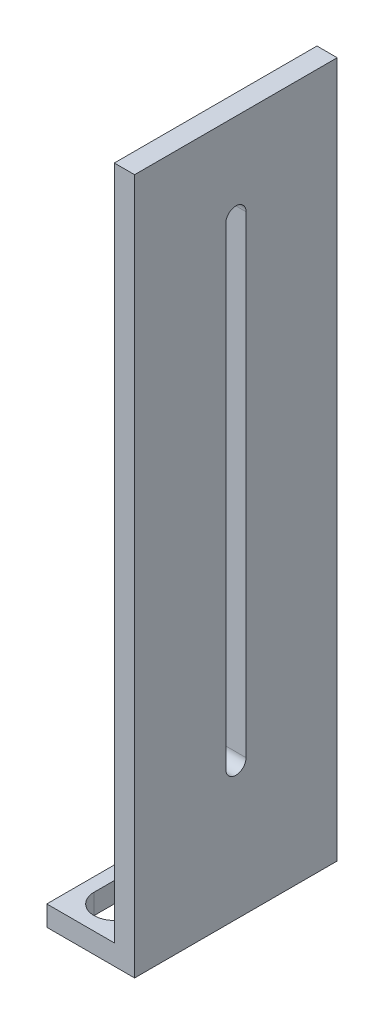
ISO-10303-21;
HEADER;
FILE_DESCRIPTION(('STEP AP214'),'2;1');
FILE_NAME('part.step','',(''),(''),'','','');
FILE_SCHEMA(('AUTOMOTIVE_DESIGN { 1 0 10303 214 1 1 1 1 }'));
ENDSEC;
DATA;
#1=APPLICATION_CONTEXT('core data for automotive mechanical design processes');
#2=APPLICATION_PROTOCOL_DEFINITION('international standard','automotive_design',2000,#1);
#3=PRODUCT_CONTEXT('',#1,'mechanical');
#4=PRODUCT('Part','Part','',(#3));
#5=PRODUCT_RELATED_PRODUCT_CATEGORY('part','',(#4));
#6=PRODUCT_DEFINITION_FORMATION('','',#4);
#7=PRODUCT_DEFINITION_CONTEXT('part definition',#1,'design');
#8=PRODUCT_DEFINITION('design','',#6,#7);
#9=PRODUCT_DEFINITION_SHAPE('','',#8);
#10=(LENGTH_UNIT() NAMED_UNIT(*) SI_UNIT(.MILLI.,.METRE.));
#11=(NAMED_UNIT(*) PLANE_ANGLE_UNIT() SI_UNIT($,.RADIAN.));
#12=(NAMED_UNIT(*) SI_UNIT($,.STERADIAN.) SOLID_ANGLE_UNIT());
#13=UNCERTAINTY_MEASURE_WITH_UNIT(LENGTH_MEASURE(1.E-05),#10,'distance_accuracy_value','');
#14=(GEOMETRIC_REPRESENTATION_CONTEXT(3) GLOBAL_UNCERTAINTY_ASSIGNED_CONTEXT((#13)) GLOBAL_UNIT_ASSIGNED_CONTEXT((#10,
#11,#12)) REPRESENTATION_CONTEXT('',''));
#15=CARTESIAN_POINT('',(0.,0.,0.));
#16=DIRECTION('',(0.,0.,1.));
#17=DIRECTION('',(1.,0.,0.));
#18=AXIS2_PLACEMENT_3D('',#15,#16,#17);
#19=CARTESIAN_POINT('',(0.,3.,0.));
#20=DIRECTION('',(0.,1.,0.));
#21=DIRECTION('',(0.,0.,1.));
#22=AXIS2_PLACEMENT_3D('',#19,#20,#21);
#23=PLANE('',#22);
#24=DIRECTION('',(-1.,0.,0.));
#25=VECTOR('',#24,1.);
#26=CARTESIAN_POINT('',(10.,3.,0.));
#27=LINE('',#26,#25);
#28=CARTESIAN_POINT('',(10.,3.,0.));
#29=VERTEX_POINT('',#28);
#30=CARTESIAN_POINT('',(0.,3.,0.));
#31=VERTEX_POINT('',#30);
#32=EDGE_CURVE('E230',#29,#31,#27,.T.);
#33=ORIENTED_EDGE('',*,*,#32,.T.);
#34=DIRECTION('',(0.,0.,1.));
#35=VECTOR('',#34,1.);
#36=CARTESIAN_POINT('',(0.,3.,0.));
#37=LINE('',#36,#35);
#38=CARTESIAN_POINT('',(0.,3.,30.));
#39=VERTEX_POINT('',#38);
#40=EDGE_CURVE('E233',#31,#39,#37,.T.);
#41=ORIENTED_EDGE('',*,*,#40,.T.);
#42=DIRECTION('',(1.,0.,0.));
#43=VECTOR('',#42,1.);
#44=CARTESIAN_POINT('',(0.,3.,30.));
#45=LINE('',#44,#43);
#46=CARTESIAN_POINT('',(10.,3.,30.));
#47=VERTEX_POINT('',#46);
#48=EDGE_CURVE('E236',#39,#47,#45,.T.);
#49=ORIENTED_EDGE('',*,*,#48,.T.);
#50=DIRECTION('',(0.,0.,-1.));
#51=VECTOR('',#50,1.);
#52=CARTESIAN_POINT('',(10.,3.,30.));
#53=LINE('',#52,#51);
#54=EDGE_CURVE('E239',#47,#29,#53,.T.);
#55=ORIENTED_EDGE('',*,*,#54,.T.);
#56=EDGE_LOOP('',(#33,#41,#49,#55));
#57=FACE_BOUND('',#56,.T.);
#58=DIRECTION('',(0.,0.,1.));
#59=VECTOR('',#58,1.);
#60=CARTESIAN_POINT('',(2.,3.,5.));
#61=LINE('',#60,#59);
#62=CARTESIAN_POINT('',(2.,3.,5.));
#63=VERTEX_POINT('',#62);
#64=CARTESIAN_POINT('',(2.,3.,25.));
#65=VERTEX_POINT('',#64);
#66=EDGE_CURVE('E201',#63,#65,#61,.T.);
#67=ORIENTED_EDGE('',*,*,#66,.F.);
#68=CARTESIAN_POINT('',(5.,3.,5.));
#69=DIRECTION('',(0.,1.,0.));
#70=DIRECTION('',(0.,0.,1.));
#71=AXIS2_PLACEMENT_3D('',#68,#69,#70);
#72=CIRCLE('',#71,3.);
#73=CARTESIAN_POINT('',(8.,3.,5.));
#74=VERTEX_POINT('',#73);
#75=EDGE_CURVE('E199',#74,#63,#72,.T.);
#76=ORIENTED_EDGE('',*,*,#75,.F.);
#77=DIRECTION('',(0.,0.,-1.));
#78=VECTOR('',#77,1.);
#79=CARTESIAN_POINT('',(8.,3.,5.));
#80=LINE('',#79,#78);
#81=CARTESIAN_POINT('',(8.,3.,25.));
#82=VERTEX_POINT('',#81);
#83=EDGE_CURVE('E207',#82,#74,#80,.T.);
#84=ORIENTED_EDGE('',*,*,#83,.F.);
#85=CARTESIAN_POINT('',(5.,3.,25.));
#86=DIRECTION('',(0.,1.,0.));
#87=DIRECTION('',(0.,0.,1.));
#88=AXIS2_PLACEMENT_3D('',#85,#86,#87);
#89=CIRCLE('',#88,3.);
#90=EDGE_CURVE('E204',#65,#82,#89,.T.);
#91=ORIENTED_EDGE('',*,*,#90,.F.);
#92=EDGE_LOOP('',(#67,#76,#84,#91));
#93=FACE_BOUND('',#92,.T.);
#94=ADVANCED_FACE('F37',(#57,#93),#23,.T.);
#95=CARTESIAN_POINT('',(0.,0.,0.));
#96=DIRECTION('',(0.,1.,0.));
#97=DIRECTION('',(0.,0.,1.));
#98=AXIS2_PLACEMENT_3D('',#95,#96,#97);
#99=PLANE('',#98);
#100=DIRECTION('',(-1.,0.,0.));
#101=VECTOR('',#100,1.);
#102=CARTESIAN_POINT('',(10.,0.,0.));
#103=LINE('',#102,#101);
#104=CARTESIAN_POINT('',(13.,0.,0.));
#105=VERTEX_POINT('',#104);
#106=CARTESIAN_POINT('',(0.,0.,0.));
#107=VERTEX_POINT('',#106);
#108=EDGE_CURVE('E229',#105,#107,#103,.T.);
#109=ORIENTED_EDGE('',*,*,#108,.F.);
#110=DIRECTION('',(0.,0.,-1.));
#111=VECTOR('',#110,1.);
#112=CARTESIAN_POINT('',(13.,0.,0.));
#113=LINE('',#112,#111);
#114=CARTESIAN_POINT('',(13.,0.,30.));
#115=VERTEX_POINT('',#114);
#116=EDGE_CURVE('E185',#115,#105,#113,.T.);
#117=ORIENTED_EDGE('',*,*,#116,.F.);
#118=DIRECTION('',(1.,0.,0.));
#119=VECTOR('',#118,1.);
#120=CARTESIAN_POINT('',(0.,0.,30.));
#121=LINE('',#120,#119);
#122=CARTESIAN_POINT('',(0.,0.,30.));
#123=VERTEX_POINT('',#122);
#124=EDGE_CURVE('E234',#123,#115,#121,.T.);
#125=ORIENTED_EDGE('',*,*,#124,.F.);
#126=DIRECTION('',(0.,0.,1.));
#127=VECTOR('',#126,1.);
#128=CARTESIAN_POINT('',(0.,0.,0.));
#129=LINE('',#128,#127);
#130=EDGE_CURVE('E244',#107,#123,#129,.T.);
#131=ORIENTED_EDGE('',*,*,#130,.F.);
#132=EDGE_LOOP('',(#109,#117,#125,#131));
#133=FACE_BOUND('',#132,.T.);
#134=CARTESIAN_POINT('',(5.,0.,5.));
#135=DIRECTION('',(0.,1.,0.));
#136=DIRECTION('',(0.,0.,1.));
#137=AXIS2_PLACEMENT_3D('',#134,#135,#136);
#138=CIRCLE('',#137,3.);
#139=CARTESIAN_POINT('',(8.,0.,5.));
#140=VERTEX_POINT('',#139);
#141=CARTESIAN_POINT('',(2.,0.,5.));
#142=VERTEX_POINT('',#141);
#143=EDGE_CURVE('E198',#140,#142,#138,.T.);
#144=ORIENTED_EDGE('',*,*,#143,.T.);
#145=DIRECTION('',(0.,0.,1.));
#146=VECTOR('',#145,1.);
#147=CARTESIAN_POINT('',(2.,0.,5.));
#148=LINE('',#147,#146);
#149=CARTESIAN_POINT('',(2.,0.,25.));
#150=VERTEX_POINT('',#149);
#151=EDGE_CURVE('E212',#142,#150,#148,.T.);
#152=ORIENTED_EDGE('',*,*,#151,.T.);
#153=CARTESIAN_POINT('',(5.,0.,25.));
#154=DIRECTION('',(0.,1.,0.));
#155=DIRECTION('',(0.,0.,1.));
#156=AXIS2_PLACEMENT_3D('',#153,#154,#155);
#157=CIRCLE('',#156,3.);
#158=CARTESIAN_POINT('',(8.,0.,25.));
#159=VERTEX_POINT('',#158);
#160=EDGE_CURVE('E215',#150,#159,#157,.T.);
#161=ORIENTED_EDGE('',*,*,#160,.T.);
#162=DIRECTION('',(0.,0.,-1.));
#163=VECTOR('',#162,1.);
#164=CARTESIAN_POINT('',(8.,0.,5.));
#165=LINE('',#164,#163);
#166=EDGE_CURVE('E202',#159,#140,#165,.T.);
#167=ORIENTED_EDGE('',*,*,#166,.T.);
#168=EDGE_LOOP('',(#144,#152,#161,#167));
#169=FACE_BOUND('',#168,.T.);
#170=ADVANCED_FACE('F256',(#133,#169),#99,.F.);
#171=CARTESIAN_POINT('',(10.,3.,0.));
#172=DIRECTION('',(0.,0.,1.));
#173=DIRECTION('',(1.,0.,0.));
#174=AXIS2_PLACEMENT_3D('',#171,#172,#173);
#175=PLANE('',#174);
#176=ORIENTED_EDGE('',*,*,#108,.T.);
#177=DIRECTION('',(0.,-1.,0.));
#178=VECTOR('',#177,1.);
#179=CARTESIAN_POINT('',(0.,3.,0.));
#180=LINE('',#179,#178);
#181=EDGE_CURVE('E11',#31,#107,#180,.T.);
#182=ORIENTED_EDGE('',*,*,#181,.F.);
#183=ORIENTED_EDGE('',*,*,#32,.F.);
#184=DIRECTION('',(0.,-1.,0.));
#185=VECTOR('',#184,1.);
#186=CARTESIAN_POINT('',(10.,0.,0.));
#187=LINE('',#186,#185);
#188=CARTESIAN_POINT('',(10.,103.,0.));
#189=VERTEX_POINT('',#188);
#190=EDGE_CURVE('E171',#189,#29,#187,.T.);
#191=ORIENTED_EDGE('',*,*,#190,.F.);
#192=DIRECTION('',(-1.,0.,0.));
#193=VECTOR('',#192,1.);
#194=CARTESIAN_POINT('',(13.,103.,0.));
#195=LINE('',#194,#193);
#196=CARTESIAN_POINT('',(13.,103.,0.));
#197=VERTEX_POINT('',#196);
#198=EDGE_CURVE('E196',#197,#189,#195,.T.);
#199=ORIENTED_EDGE('',*,*,#198,.F.);
#200=DIRECTION('',(0.,-1.,0.));
#201=VECTOR('',#200,1.);
#202=CARTESIAN_POINT('',(13.,0.,0.));
#203=LINE('',#202,#201);
#204=EDGE_CURVE('E175',#197,#105,#203,.T.);
#205=ORIENTED_EDGE('',*,*,#204,.T.);
#206=EDGE_LOOP('',(#176,#182,#183,#191,#199,#205));
#207=FACE_BOUND('',#206,.T.);
#208=ADVANCED_FACE('F39',(#207),#175,.F.);
#209=CARTESIAN_POINT('',(0.,3.,0.));
#210=DIRECTION('',(1.,0.,0.));
#211=DIRECTION('',(0.,0.,-1.));
#212=AXIS2_PLACEMENT_3D('',#209,#210,#211);
#213=PLANE('',#212);
#214=ORIENTED_EDGE('',*,*,#130,.T.);
#215=DIRECTION('',(0.,-1.,0.));
#216=VECTOR('',#215,1.);
#217=CARTESIAN_POINT('',(0.,3.,30.));
#218=LINE('',#217,#216);
#219=EDGE_CURVE('E45',#39,#123,#218,.T.);
#220=ORIENTED_EDGE('',*,*,#219,.F.);
#221=ORIENTED_EDGE('',*,*,#40,.F.);
#222=ORIENTED_EDGE('',*,*,#181,.T.);
#223=EDGE_LOOP('',(#214,#220,#221,#222));
#224=FACE_BOUND('',#223,.T.);
#225=ADVANCED_FACE('F272',(#224),#213,.F.);
#226=CARTESIAN_POINT('',(0.,3.,30.));
#227=DIRECTION('',(0.,0.,-1.));
#228=DIRECTION('',(-1.,0.,0.));
#229=AXIS2_PLACEMENT_3D('',#226,#227,#228);
#230=PLANE('',#229);
#231=ORIENTED_EDGE('',*,*,#124,.T.);
#232=DIRECTION('',(0.,1.,0.));
#233=VECTOR('',#232,1.);
#234=CARTESIAN_POINT('',(13.,0.,30.));
#235=LINE('',#234,#233);
#236=CARTESIAN_POINT('',(13.,103.,30.));
#237=VERTEX_POINT('',#236);
#238=EDGE_CURVE('E182',#115,#237,#235,.T.);
#239=ORIENTED_EDGE('',*,*,#238,.T.);
#240=DIRECTION('',(-1.,0.,0.));
#241=VECTOR('',#240,1.);
#242=CARTESIAN_POINT('',(13.,103.,30.));
#243=LINE('',#242,#241);
#244=CARTESIAN_POINT('',(10.,103.,30.));
#245=VERTEX_POINT('',#244);
#246=EDGE_CURVE('E188',#237,#245,#243,.T.);
#247=ORIENTED_EDGE('',*,*,#246,.T.);
#248=DIRECTION('',(0.,1.,0.));
#249=VECTOR('',#248,1.);
#250=CARTESIAN_POINT('',(10.,0.,30.));
#251=LINE('',#250,#249);
#252=EDGE_CURVE('E179',#47,#245,#251,.T.);
#253=ORIENTED_EDGE('',*,*,#252,.F.);
#254=ORIENTED_EDGE('',*,*,#48,.F.);
#255=ORIENTED_EDGE('',*,*,#219,.T.);
#256=EDGE_LOOP('',(#231,#239,#247,#253,#254,#255));
#257=FACE_BOUND('',#256,.T.);
#258=ADVANCED_FACE('F251',(#257),#230,.F.);
#259=CARTESIAN_POINT('',(5.,3.,5.));
#260=DIRECTION('',(0.,-1.,0.));
#261=DIRECTION('',(0.,0.,-1.));
#262=AXIS2_PLACEMENT_3D('',#259,#260,#261);
#263=CYLINDRICAL_SURFACE('',#262,3.);
#264=ORIENTED_EDGE('',*,*,#143,.F.);
#265=DIRECTION('',(0.,-1.,0.));
#266=VECTOR('',#265,1.);
#267=CARTESIAN_POINT('',(8.,3.,5.));
#268=LINE('',#267,#266);
#269=EDGE_CURVE('E209',#74,#140,#268,.T.);
#270=ORIENTED_EDGE('',*,*,#269,.F.);
#271=ORIENTED_EDGE('',*,*,#75,.T.);
#272=DIRECTION('',(0.,-1.,0.));
#273=VECTOR('',#272,1.);
#274=CARTESIAN_POINT('',(2.,3.,5.));
#275=LINE('',#274,#273);
#276=EDGE_CURVE('E226',#63,#142,#275,.T.);
#277=ORIENTED_EDGE('',*,*,#276,.T.);
#278=EDGE_LOOP('',(#264,#270,#271,#277));
#279=FACE_BOUND('',#278,.T.);
#280=ADVANCED_FACE('F278',(#279),#263,.F.);
#281=CARTESIAN_POINT('',(2.,3.,5.));
#282=DIRECTION('',(1.,0.,0.));
#283=DIRECTION('',(0.,0.,-1.));
#284=AXIS2_PLACEMENT_3D('',#281,#282,#283);
#285=PLANE('',#284);
#286=ORIENTED_EDGE('',*,*,#151,.F.);
#287=ORIENTED_EDGE('',*,*,#276,.F.);
#288=ORIENTED_EDGE('',*,*,#66,.T.);
#289=DIRECTION('',(0.,-1.,0.));
#290=VECTOR('',#289,1.);
#291=CARTESIAN_POINT('',(2.,3.,25.));
#292=LINE('',#291,#290);
#293=EDGE_CURVE('E224',#65,#150,#292,.T.);
#294=ORIENTED_EDGE('',*,*,#293,.T.);
#295=EDGE_LOOP('',(#286,#287,#288,#294));
#296=FACE_BOUND('',#295,.T.);
#297=ADVANCED_FACE('F289',(#296),#285,.T.);
#298=CARTESIAN_POINT('',(5.,3.,25.));
#299=DIRECTION('',(0.,-1.,0.));
#300=DIRECTION('',(0.,0.,-1.));
#301=AXIS2_PLACEMENT_3D('',#298,#299,#300);
#302=CYLINDRICAL_SURFACE('',#301,3.);
#303=ORIENTED_EDGE('',*,*,#160,.F.);
#304=ORIENTED_EDGE('',*,*,#293,.F.);
#305=ORIENTED_EDGE('',*,*,#90,.T.);
#306=DIRECTION('',(0.,-1.,0.));
#307=VECTOR('',#306,1.);
#308=CARTESIAN_POINT('',(8.,3.,25.));
#309=LINE('',#308,#307);
#310=EDGE_CURVE('E222',#82,#159,#309,.T.);
#311=ORIENTED_EDGE('',*,*,#310,.T.);
#312=EDGE_LOOP('',(#303,#304,#305,#311));
#313=FACE_BOUND('',#312,.T.);
#314=ADVANCED_FACE('F293',(#313),#302,.F.);
#315=CARTESIAN_POINT('',(8.,3.,5.));
#316=DIRECTION('',(-1.,0.,0.));
#317=DIRECTION('',(0.,0.,1.));
#318=AXIS2_PLACEMENT_3D('',#315,#316,#317);
#319=PLANE('',#318);
#320=ORIENTED_EDGE('',*,*,#166,.F.);
#321=ORIENTED_EDGE('',*,*,#310,.F.);
#322=ORIENTED_EDGE('',*,*,#83,.T.);
#323=ORIENTED_EDGE('',*,*,#269,.T.);
#324=EDGE_LOOP('',(#320,#321,#322,#323));
#325=FACE_BOUND('',#324,.T.);
#326=ADVANCED_FACE('F297',(#325),#319,.T.);
#327=CARTESIAN_POINT('',(13.,103.,0.));
#328=DIRECTION('',(0.,1.,0.));
#329=DIRECTION('',(0.,0.,1.));
#330=AXIS2_PLACEMENT_3D('',#327,#328,#329);
#331=PLANE('',#330);
#332=DIRECTION('',(0.,0.,-1.));
#333=VECTOR('',#332,1.);
#334=CARTESIAN_POINT('',(10.,103.,0.));
#335=LINE('',#334,#333);
#336=EDGE_CURVE('E190',#245,#189,#335,.T.);
#337=ORIENTED_EDGE('',*,*,#336,.F.);
#338=ORIENTED_EDGE('',*,*,#246,.F.);
#339=DIRECTION('',(0.,0.,-1.));
#340=VECTOR('',#339,1.);
#341=CARTESIAN_POINT('',(13.,103.,0.));
#342=LINE('',#341,#340);
#343=EDGE_CURVE('E178',#237,#197,#342,.T.);
#344=ORIENTED_EDGE('',*,*,#343,.T.);
#345=ORIENTED_EDGE('',*,*,#198,.T.);
#346=EDGE_LOOP('',(#337,#338,#344,#345));
#347=FACE_BOUND('',#346,.T.);
#348=ADVANCED_FACE('F263',(#347),#331,.T.);
#349=CARTESIAN_POINT('',(13.,0.,0.));
#350=DIRECTION('',(1.,0.,0.));
#351=DIRECTION('',(0.,0.,-1.));
#352=AXIS2_PLACEMENT_3D('',#349,#350,#351);
#353=PLANE('',#352);
#354=CARTESIAN_POINT('',(13.,90.,15.));
#355=DIRECTION('',(-1.,0.,0.));
#356=DIRECTION('',(0.,0.,1.));
#357=AXIS2_PLACEMENT_3D('',#354,#355,#356);
#358=CIRCLE('',#357,1.5);
#359=CARTESIAN_POINT('',(13.,90.,16.5));
#360=VERTEX_POINT('',#359);
#361=CARTESIAN_POINT('',(13.,90.,13.5));
#362=VERTEX_POINT('',#361);
#363=EDGE_CURVE('E140',#360,#362,#358,.T.);
#364=ORIENTED_EDGE('',*,*,#363,.T.);
#365=DIRECTION('',(0.,-1.,0.));
#366=VECTOR('',#365,1.);
#367=CARTESIAN_POINT('',(13.,90.,13.5));
#368=LINE('',#367,#366);
#369=CARTESIAN_POINT('',(13.,20.,13.5));
#370=VERTEX_POINT('',#369);
#371=EDGE_CURVE('E149',#362,#370,#368,.T.);
#372=ORIENTED_EDGE('',*,*,#371,.T.);
#373=CARTESIAN_POINT('',(13.,20.,15.));
#374=DIRECTION('',(-1.,0.,0.));
#375=DIRECTION('',(0.,0.,1.));
#376=AXIS2_PLACEMENT_3D('',#373,#374,#375);
#377=CIRCLE('',#376,1.5);
#378=CARTESIAN_POINT('',(13.,20.,16.5));
#379=VERTEX_POINT('',#378);
#380=EDGE_CURVE('E52',#370,#379,#377,.T.);
#381=ORIENTED_EDGE('',*,*,#380,.T.);
#382=DIRECTION('',(0.,1.,0.));
#383=VECTOR('',#382,1.);
#384=CARTESIAN_POINT('',(13.,90.,16.5));
#385=LINE('',#384,#383);
#386=EDGE_CURVE('E146',#379,#360,#385,.T.);
#387=ORIENTED_EDGE('',*,*,#386,.T.);
#388=EDGE_LOOP('',(#364,#372,#381,#387));
#389=FACE_BOUND('',#388,.T.);
#390=ORIENTED_EDGE('',*,*,#204,.F.);
#391=ORIENTED_EDGE('',*,*,#343,.F.);
#392=ORIENTED_EDGE('',*,*,#238,.F.);
#393=ORIENTED_EDGE('',*,*,#116,.T.);
#394=EDGE_LOOP('',(#390,#391,#392,#393));
#395=FACE_BOUND('',#394,.T.);
#396=ADVANCED_FACE('F153',(#389,#395),#353,.T.);
#397=CARTESIAN_POINT('',(10.,0.,0.));
#398=DIRECTION('',(1.,0.,0.));
#399=DIRECTION('',(0.,0.,-1.));
#400=AXIS2_PLACEMENT_3D('',#397,#398,#399);
#401=PLANE('',#400);
#402=DIRECTION('',(0.,-1.,0.));
#403=VECTOR('',#402,1.);
#404=CARTESIAN_POINT('',(10.,90.,13.5));
#405=LINE('',#404,#403);
#406=CARTESIAN_POINT('',(10.,90.,13.5));
#407=VERTEX_POINT('',#406);
#408=CARTESIAN_POINT('',(10.,20.,13.5));
#409=VERTEX_POINT('',#408);
#410=EDGE_CURVE('E165',#407,#409,#405,.T.);
#411=ORIENTED_EDGE('',*,*,#410,.F.);
#412=CARTESIAN_POINT('',(10.,90.,15.));
#413=DIRECTION('',(-1.,0.,0.));
#414=DIRECTION('',(0.,0.,1.));
#415=AXIS2_PLACEMENT_3D('',#412,#413,#414);
#416=CIRCLE('',#415,1.5);
#417=CARTESIAN_POINT('',(10.,90.,16.5));
#418=VERTEX_POINT('',#417);
#419=EDGE_CURVE('E60',#418,#407,#416,.T.);
#420=ORIENTED_EDGE('',*,*,#419,.F.);
#421=DIRECTION('',(0.,1.,0.));
#422=VECTOR('',#421,1.);
#423=CARTESIAN_POINT('',(10.,90.,16.5));
#424=LINE('',#423,#422);
#425=CARTESIAN_POINT('',(10.,20.,16.5));
#426=VERTEX_POINT('',#425);
#427=EDGE_CURVE('E156',#426,#418,#424,.T.);
#428=ORIENTED_EDGE('',*,*,#427,.F.);
#429=CARTESIAN_POINT('',(10.,20.,15.));
#430=DIRECTION('',(-1.,0.,0.));
#431=DIRECTION('',(0.,0.,1.));
#432=AXIS2_PLACEMENT_3D('',#429,#430,#431);
#433=CIRCLE('',#432,1.5);
#434=EDGE_CURVE('E159',#409,#426,#433,.T.);
#435=ORIENTED_EDGE('',*,*,#434,.F.);
#436=EDGE_LOOP('',(#411,#420,#428,#435));
#437=FACE_BOUND('',#436,.T.);
#438=ORIENTED_EDGE('',*,*,#54,.F.);
#439=ORIENTED_EDGE('',*,*,#252,.T.);
#440=ORIENTED_EDGE('',*,*,#336,.T.);
#441=ORIENTED_EDGE('',*,*,#190,.T.);
#442=EDGE_LOOP('',(#438,#439,#440,#441));
#443=FACE_BOUND('',#442,.T.);
#444=ADVANCED_FACE('F266',(#437,#443),#401,.F.);
#445=CARTESIAN_POINT('',(13.,90.,15.));
#446=DIRECTION('',(-1.,0.,0.));
#447=DIRECTION('',(0.,0.,1.));
#448=AXIS2_PLACEMENT_3D('',#445,#446,#447);
#449=CYLINDRICAL_SURFACE('',#448,1.5);
#450=ORIENTED_EDGE('',*,*,#419,.T.);
#451=DIRECTION('',(-1.,0.,0.));
#452=VECTOR('',#451,1.);
#453=CARTESIAN_POINT('',(13.,90.,13.5));
#454=LINE('',#453,#452);
#455=EDGE_CURVE('E136',#362,#407,#454,.T.);
#456=ORIENTED_EDGE('',*,*,#455,.F.);
#457=ORIENTED_EDGE('',*,*,#363,.F.);
#458=DIRECTION('',(-1.,0.,0.));
#459=VECTOR('',#458,1.);
#460=CARTESIAN_POINT('',(13.,90.,16.5));
#461=LINE('',#460,#459);
#462=EDGE_CURVE('E169',#360,#418,#461,.T.);
#463=ORIENTED_EDGE('',*,*,#462,.T.);
#464=EDGE_LOOP('',(#450,#456,#457,#463));
#465=FACE_BOUND('',#464,.T.);
#466=ADVANCED_FACE('F138',(#465),#449,.F.);
#467=CARTESIAN_POINT('',(13.,90.,16.5));
#468=DIRECTION('',(0.,0.,1.));
#469=DIRECTION('',(0.,-1.,0.));
#470=AXIS2_PLACEMENT_3D('',#467,#468,#469);
#471=PLANE('',#470);
#472=ORIENTED_EDGE('',*,*,#427,.T.);
#473=ORIENTED_EDGE('',*,*,#462,.F.);
#474=ORIENTED_EDGE('',*,*,#386,.F.);
#475=DIRECTION('',(-1.,0.,0.));
#476=VECTOR('',#475,1.);
#477=CARTESIAN_POINT('',(13.,20.,16.5));
#478=LINE('',#477,#476);
#479=EDGE_CURVE('E172',#379,#426,#478,.T.);
#480=ORIENTED_EDGE('',*,*,#479,.T.);
#481=EDGE_LOOP('',(#472,#473,#474,#480));
#482=FACE_BOUND('',#481,.T.);
#483=ADVANCED_FACE('F311',(#482),#471,.F.);
#484=CARTESIAN_POINT('',(13.,20.,15.));
#485=DIRECTION('',(-1.,0.,0.));
#486=DIRECTION('',(0.,0.,1.));
#487=AXIS2_PLACEMENT_3D('',#484,#485,#486);
#488=CYLINDRICAL_SURFACE('',#487,1.5);
#489=ORIENTED_EDGE('',*,*,#434,.T.);
#490=ORIENTED_EDGE('',*,*,#479,.F.);
#491=ORIENTED_EDGE('',*,*,#380,.F.);
#492=DIRECTION('',(-1.,0.,0.));
#493=VECTOR('',#492,1.);
#494=CARTESIAN_POINT('',(13.,20.,13.5));
#495=LINE('',#494,#493);
#496=EDGE_CURVE('E145',#370,#409,#495,.T.);
#497=ORIENTED_EDGE('',*,*,#496,.T.);
#498=EDGE_LOOP('',(#489,#490,#491,#497));
#499=FACE_BOUND('',#498,.T.);
#500=ADVANCED_FACE('F314',(#499),#488,.F.);
#501=CARTESIAN_POINT('',(13.,90.,13.5));
#502=DIRECTION('',(0.,0.,-1.));
#503=DIRECTION('',(0.,1.,0.));
#504=AXIS2_PLACEMENT_3D('',#501,#502,#503);
#505=PLANE('',#504);
#506=ORIENTED_EDGE('',*,*,#410,.T.);
#507=ORIENTED_EDGE('',*,*,#496,.F.);
#508=ORIENTED_EDGE('',*,*,#371,.F.);
#509=ORIENTED_EDGE('',*,*,#455,.T.);
#510=EDGE_LOOP('',(#506,#507,#508,#509));
#511=FACE_BOUND('',#510,.T.);
#512=ADVANCED_FACE('F150',(#511),#505,.F.);
#513=CLOSED_SHELL('',(#94,#170,#208,#225,#258,#280,#297,#314,#326,#348,#396,#444,#466,#483,#500,#512));
#514=MANIFOLD_SOLID_BREP('B2',#513);
#515=ADVANCED_BREP_SHAPE_REPRESENTATION('',(#18,#514),#14);
#516=SHAPE_DEFINITION_REPRESENTATION(#9,#515);
ENDSEC;
END-ISO-10303-21;
